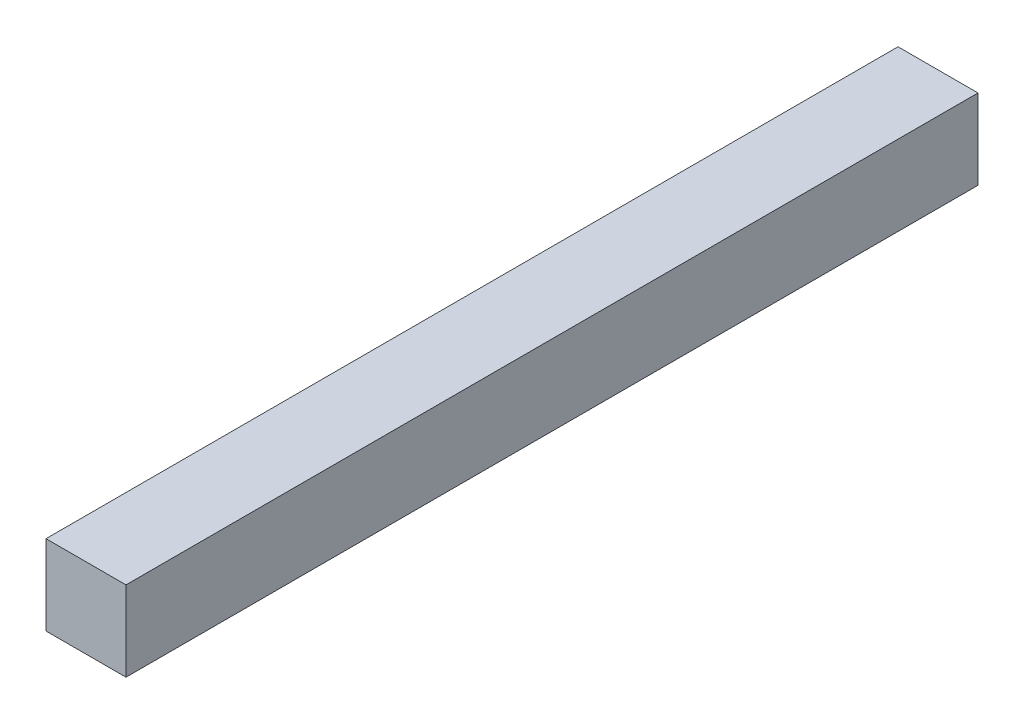
ISO-10303-21;
HEADER;
FILE_DESCRIPTION(('STEP AP214'),'2;1');
FILE_NAME('part.step','',(''),(''),'','','');
FILE_SCHEMA(('AUTOMOTIVE_DESIGN { 1 0 10303 214 1 1 1 1 }'));
ENDSEC;
DATA;
#1=APPLICATION_CONTEXT('core data for automotive mechanical design processes');
#2=APPLICATION_PROTOCOL_DEFINITION('international standard','automotive_design',2000,#1);
#3=PRODUCT_CONTEXT('',#1,'mechanical');
#4=PRODUCT('Part','Part','',(#3));
#5=PRODUCT_RELATED_PRODUCT_CATEGORY('part','',(#4));
#6=PRODUCT_DEFINITION_FORMATION('','',#4);
#7=PRODUCT_DEFINITION_CONTEXT('part definition',#1,'design');
#8=PRODUCT_DEFINITION('design','',#6,#7);
#9=PRODUCT_DEFINITION_SHAPE('','',#8);
#10=(LENGTH_UNIT() NAMED_UNIT(*) SI_UNIT(.MILLI.,.METRE.));
#11=(NAMED_UNIT(*) PLANE_ANGLE_UNIT() SI_UNIT($,.RADIAN.));
#12=(NAMED_UNIT(*) SI_UNIT($,.STERADIAN.) SOLID_ANGLE_UNIT());
#13=UNCERTAINTY_MEASURE_WITH_UNIT(LENGTH_MEASURE(1.E-05),#10,'distance_accuracy_value','');
#14=(GEOMETRIC_REPRESENTATION_CONTEXT(3) GLOBAL_UNCERTAINTY_ASSIGNED_CONTEXT((#13)) GLOBAL_UNIT_ASSIGNED_CONTEXT((#10,
#11,#12)) REPRESENTATION_CONTEXT('',''));
#15=CARTESIAN_POINT('',(0.,0.,0.));
#16=DIRECTION('',(0.,0.,1.));
#17=DIRECTION('',(1.,0.,0.));
#18=AXIS2_PLACEMENT_3D('',#15,#16,#17);
#19=CARTESIAN_POINT('',(0.00999998,0.00999998,0.));
#20=DIRECTION('',(1.,0.,0.));
#21=DIRECTION('',(0.,0.,-1.));
#22=AXIS2_PLACEMENT_3D('',#19,#20,#21);
#23=PLANE('',#22);
#24=DIRECTION('',(0.,0.,-1.));
#25=VECTOR('',#24,1.);
#26=CARTESIAN_POINT('',(0.00999998,0.,0.));
#27=LINE('',#26,#25);
#28=CARTESIAN_POINT('',(0.00999998,0.,0.));
#29=VERTEX_POINT('',#28);
#30=CARTESIAN_POINT('',(0.00999998,0.,0.10651998));
#31=VERTEX_POINT('',#30);
#32=EDGE_CURVE('E19',#29,#31,#27,.F.);
#33=ORIENTED_EDGE('',*,*,#32,.F.);
#34=DIRECTION('',(0.,1.,0.));
#35=VECTOR('',#34,1.);
#36=CARTESIAN_POINT('',(0.00999998,0.,0.));
#37=LINE('',#36,#35);
#38=CARTESIAN_POINT('',(0.00999998,0.00999998,0.));
#39=VERTEX_POINT('',#38);
#40=EDGE_CURVE('E89',#29,#39,#37,.T.);
#41=ORIENTED_EDGE('',*,*,#40,.T.);
#42=DIRECTION('',(0.,0.,1.));
#43=VECTOR('',#42,1.);
#44=CARTESIAN_POINT('',(0.00999998,0.00999998,0.));
#45=LINE('',#44,#43);
#46=CARTESIAN_POINT('',(0.00999998,0.00999998,0.10651998));
#47=VERTEX_POINT('',#46);
#48=EDGE_CURVE('E69',#47,#39,#45,.F.);
#49=ORIENTED_EDGE('',*,*,#48,.F.);
#50=DIRECTION('',(0.,1.,0.));
#51=VECTOR('',#50,1.);
#52=CARTESIAN_POINT('',(0.00999998,0.,0.10651998));
#53=LINE('',#52,#51);
#54=EDGE_CURVE('E56',#31,#47,#53,.T.);
#55=ORIENTED_EDGE('',*,*,#54,.F.);
#56=EDGE_LOOP('',(#33,#41,#49,#55));
#57=FACE_BOUND('',#56,.T.);
#58=ADVANCED_FACE('F16',(#57),#23,.T.);
#59=CARTESIAN_POINT('',(0.00999998,0.,0.));
#60=DIRECTION('',(0.,-1.,0.));
#61=DIRECTION('',(0.,0.,-1.));
#62=AXIS2_PLACEMENT_3D('',#59,#60,#61);
#63=PLANE('',#62);
#64=DIRECTION('',(0.,0.,1.));
#65=VECTOR('',#64,1.);
#66=CARTESIAN_POINT('',(0.,0.,0.));
#67=LINE('',#66,#65);
#68=CARTESIAN_POINT('',(0.,0.,0.));
#69=VERTEX_POINT('',#68);
#70=CARTESIAN_POINT('',(0.,0.,0.10651998));
#71=VERTEX_POINT('',#70);
#72=EDGE_CURVE('E93',#69,#71,#67,.T.);
#73=ORIENTED_EDGE('',*,*,#72,.F.);
#74=DIRECTION('',(1.,0.,0.));
#75=VECTOR('',#74,1.);
#76=CARTESIAN_POINT('',(0.,0.,0.));
#77=LINE('',#76,#75);
#78=EDGE_CURVE('E65',#69,#29,#77,.T.);
#79=ORIENTED_EDGE('',*,*,#78,.T.);
#80=ORIENTED_EDGE('',*,*,#32,.T.);
#81=DIRECTION('',(1.,0.,0.));
#82=VECTOR('',#81,1.);
#83=CARTESIAN_POINT('',(0.,0.,0.10651998));
#84=LINE('',#83,#82);
#85=EDGE_CURVE('E62',#71,#31,#84,.T.);
#86=ORIENTED_EDGE('',*,*,#85,.F.);
#87=EDGE_LOOP('',(#73,#79,#80,#86));
#88=FACE_BOUND('',#87,.T.);
#89=ADVANCED_FACE('F61',(#88),#63,.T.);
#90=CARTESIAN_POINT('',(0.,0.,0.10651998));
#91=DIRECTION('',(0.,0.,1.));
#92=DIRECTION('',(1.,0.,0.));
#93=AXIS2_PLACEMENT_3D('',#90,#91,#92);
#94=PLANE('',#93);
#95=DIRECTION('',(1.,0.,0.));
#96=VECTOR('',#95,1.);
#97=CARTESIAN_POINT('',(0.,0.00999998,0.10651998));
#98=LINE('',#97,#96);
#99=CARTESIAN_POINT('',(0.,0.00999998,0.10651998));
#100=VERTEX_POINT('',#99);
#101=EDGE_CURVE('E72',#100,#47,#98,.T.);
#102=ORIENTED_EDGE('',*,*,#101,.F.);
#103=DIRECTION('',(0.,1.,0.));
#104=VECTOR('',#103,1.);
#105=CARTESIAN_POINT('',(0.,0.,0.10651998));
#106=LINE('',#105,#104);
#107=EDGE_CURVE('E76',#71,#100,#106,.T.);
#108=ORIENTED_EDGE('',*,*,#107,.F.);
#109=ORIENTED_EDGE('',*,*,#85,.T.);
#110=ORIENTED_EDGE('',*,*,#54,.T.);
#111=EDGE_LOOP('',(#102,#108,#109,#110));
#112=FACE_BOUND('',#111,.T.);
#113=ADVANCED_FACE('F74',(#112),#94,.T.);
#114=CARTESIAN_POINT('',(0.,0.00999998,0.));
#115=DIRECTION('',(0.,1.,0.));
#116=DIRECTION('',(0.,0.,1.));
#117=AXIS2_PLACEMENT_3D('',#114,#115,#116);
#118=PLANE('',#117);
#119=ORIENTED_EDGE('',*,*,#48,.T.);
#120=DIRECTION('',(1.,0.,0.));
#121=VECTOR('',#120,1.);
#122=CARTESIAN_POINT('',(0.,0.00999998,0.));
#123=LINE('',#122,#121);
#124=CARTESIAN_POINT('',(0.,0.00999998,0.));
#125=VERTEX_POINT('',#124);
#126=EDGE_CURVE('E35',#39,#125,#123,.F.);
#127=ORIENTED_EDGE('',*,*,#126,.T.);
#128=DIRECTION('',(0.,0.,1.));
#129=VECTOR('',#128,1.);
#130=CARTESIAN_POINT('',(0.,0.00999998,0.));
#131=LINE('',#130,#129);
#132=EDGE_CURVE('E26',#100,#125,#131,.F.);
#133=ORIENTED_EDGE('',*,*,#132,.F.);
#134=ORIENTED_EDGE('',*,*,#101,.T.);
#135=EDGE_LOOP('',(#119,#127,#133,#134));
#136=FACE_BOUND('',#135,.T.);
#137=ADVANCED_FACE('F103',(#136),#118,.T.);
#138=CARTESIAN_POINT('',(0.,0.,0.));
#139=DIRECTION('',(0.,0.,1.));
#140=DIRECTION('',(1.,0.,0.));
#141=AXIS2_PLACEMENT_3D('',#138,#139,#140);
#142=PLANE('',#141);
#143=ORIENTED_EDGE('',*,*,#126,.F.);
#144=ORIENTED_EDGE('',*,*,#40,.F.);
#145=ORIENTED_EDGE('',*,*,#78,.F.);
#146=DIRECTION('',(0.,1.,0.));
#147=VECTOR('',#146,1.);
#148=CARTESIAN_POINT('',(0.,0.,0.));
#149=LINE('',#148,#147);
#150=EDGE_CURVE('E11',#125,#69,#149,.F.);
#151=ORIENTED_EDGE('',*,*,#150,.F.);
#152=EDGE_LOOP('',(#143,#144,#145,#151));
#153=FACE_BOUND('',#152,.T.);
#154=ADVANCED_FACE('F105',(#153),#142,.F.);
#155=CARTESIAN_POINT('',(0.,0.,0.));
#156=DIRECTION('',(-1.,0.,0.));
#157=DIRECTION('',(0.,0.,1.));
#158=AXIS2_PLACEMENT_3D('',#155,#156,#157);
#159=PLANE('',#158);
#160=ORIENTED_EDGE('',*,*,#132,.T.);
#161=ORIENTED_EDGE('',*,*,#150,.T.);
#162=ORIENTED_EDGE('',*,*,#72,.T.);
#163=ORIENTED_EDGE('',*,*,#107,.T.);
#164=EDGE_LOOP('',(#160,#161,#162,#163));
#165=FACE_BOUND('',#164,.T.);
#166=ADVANCED_FACE('F102',(#165),#159,.T.);
#167=CLOSED_SHELL('',(#58,#89,#113,#137,#154,#166));
#168=MANIFOLD_SOLID_BREP('B1',#167);
#169=ADVANCED_BREP_SHAPE_REPRESENTATION('',(#18,#168),#14);
#170=SHAPE_DEFINITION_REPRESENTATION(#9,#169);
ENDSEC;
END-ISO-10303-21;
